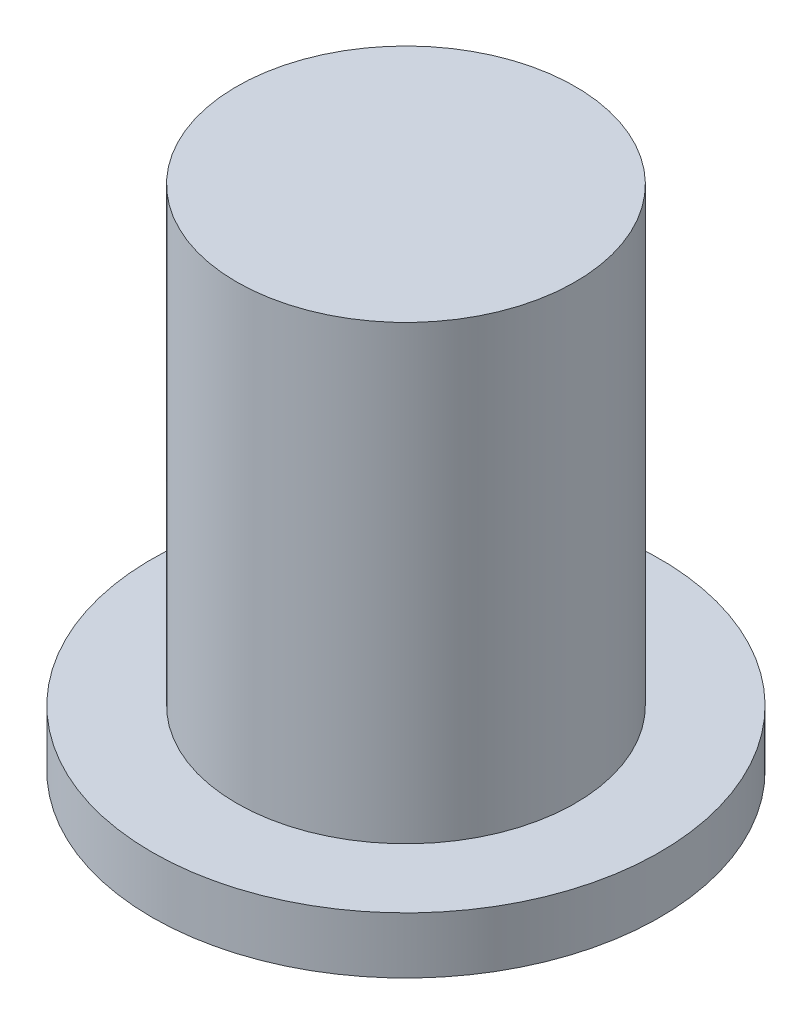
ISO-10303-21;
HEADER;
FILE_DESCRIPTION(('STEP AP214'),'2;1');
FILE_NAME('part.step','',(''),(''),'','','');
FILE_SCHEMA(('AUTOMOTIVE_DESIGN { 1 0 10303 214 1 1 1 1 }'));
ENDSEC;
DATA;
#1=APPLICATION_CONTEXT('core data for automotive mechanical design processes');
#2=APPLICATION_PROTOCOL_DEFINITION('international standard','automotive_design',2000,#1);
#3=PRODUCT_CONTEXT('',#1,'mechanical');
#4=PRODUCT('Part','Part','',(#3));
#5=PRODUCT_RELATED_PRODUCT_CATEGORY('part','',(#4));
#6=PRODUCT_DEFINITION_FORMATION('','',#4);
#7=PRODUCT_DEFINITION_CONTEXT('part definition',#1,'design');
#8=PRODUCT_DEFINITION('design','',#6,#7);
#9=PRODUCT_DEFINITION_SHAPE('','',#8);
#10=(LENGTH_UNIT() NAMED_UNIT(*) SI_UNIT(.MILLI.,.METRE.));
#11=(NAMED_UNIT(*) PLANE_ANGLE_UNIT() SI_UNIT($,.RADIAN.));
#12=(NAMED_UNIT(*) SI_UNIT($,.STERADIAN.) SOLID_ANGLE_UNIT());
#13=UNCERTAINTY_MEASURE_WITH_UNIT(LENGTH_MEASURE(1.E-05),#10,'distance_accuracy_value','');
#14=(GEOMETRIC_REPRESENTATION_CONTEXT(3) GLOBAL_UNCERTAINTY_ASSIGNED_CONTEXT((#13)) GLOBAL_UNIT_ASSIGNED_CONTEXT((#10,
#11,#12)) REPRESENTATION_CONTEXT('',''));
#15=CARTESIAN_POINT('',(0.,0.,0.));
#16=DIRECTION('',(0.,0.,1.));
#17=DIRECTION('',(1.,0.,0.));
#18=AXIS2_PLACEMENT_3D('',#15,#16,#17);
#19=CARTESIAN_POINT('',(0.,1.,0.));
#20=DIRECTION('',(0.,-1.,0.));
#21=DIRECTION('',(0.,0.,-1.));
#22=AXIS2_PLACEMENT_3D('',#19,#20,#21);
#23=CYLINDRICAL_SURFACE('',#22,4.5);
#24=CARTESIAN_POINT('',(0.,1.,0.));
#25=DIRECTION('',(0.,1.,0.));
#26=DIRECTION('',(0.,0.,1.));
#27=AXIS2_PLACEMENT_3D('',#24,#25,#26);
#28=CIRCLE('',#27,4.5);
#29=CARTESIAN_POINT('',(0.,1.,4.5));
#30=VERTEX_POINT('',#29);
#31=EDGE_CURVE('E10',#30,#30,#28,.T.);
#32=ORIENTED_EDGE('',*,*,#31,.F.);
#33=EDGE_LOOP('',(#32));
#34=FACE_BOUND('',#33,.T.);
#35=CARTESIAN_POINT('',(0.,0.,0.));
#36=DIRECTION('',(0.,1.,0.));
#37=DIRECTION('',(0.,0.,1.));
#38=AXIS2_PLACEMENT_3D('',#35,#36,#37);
#39=CIRCLE('',#38,4.5);
#40=CARTESIAN_POINT('',(0.,0.,4.5));
#41=VERTEX_POINT('',#40);
#42=EDGE_CURVE('E38',#41,#41,#39,.T.);
#43=ORIENTED_EDGE('',*,*,#42,.T.);
#44=EDGE_LOOP('',(#43));
#45=FACE_BOUND('',#44,.T.);
#46=ADVANCED_FACE('F35',(#34,#45),#23,.T.);
#47=CARTESIAN_POINT('',(0.,1.,0.));
#48=DIRECTION('',(0.,1.,0.));
#49=DIRECTION('',(0.,0.,1.));
#50=AXIS2_PLACEMENT_3D('',#47,#48,#49);
#51=PLANE('',#50);
#52=CARTESIAN_POINT('',(0.,1.,0.));
#53=DIRECTION('',(0.,1.,0.));
#54=DIRECTION('',(0.,0.,1.));
#55=AXIS2_PLACEMENT_3D('',#52,#53,#54);
#56=CIRCLE('',#55,3.);
#57=CARTESIAN_POINT('',(0.,1.,3.));
#58=VERTEX_POINT('',#57);
#59=EDGE_CURVE('E49',#58,#58,#56,.T.);
#60=ORIENTED_EDGE('',*,*,#59,.F.);
#61=EDGE_LOOP('',(#60));
#62=FACE_BOUND('',#61,.T.);
#63=ORIENTED_EDGE('',*,*,#31,.T.);
#64=EDGE_LOOP('',(#63));
#65=FACE_BOUND('',#64,.T.);
#66=ADVANCED_FACE('F65',(#62,#65),#51,.T.);
#67=CARTESIAN_POINT('',(0.,0.,0.));
#68=DIRECTION('',(0.,1.,0.));
#69=DIRECTION('',(0.,0.,1.));
#70=AXIS2_PLACEMENT_3D('',#67,#68,#69);
#71=PLANE('',#70);
#72=ORIENTED_EDGE('',*,*,#42,.F.);
#73=EDGE_LOOP('',(#72));
#74=FACE_BOUND('',#73,.T.);
#75=ADVANCED_FACE('F61',(#74),#71,.F.);
#76=CARTESIAN_POINT('',(0.,9.,0.));
#77=DIRECTION('',(0.,-1.,0.));
#78=DIRECTION('',(0.,0.,-1.));
#79=AXIS2_PLACEMENT_3D('',#76,#77,#78);
#80=CYLINDRICAL_SURFACE('',#79,3.);
#81=CARTESIAN_POINT('',(0.,9.,0.));
#82=DIRECTION('',(0.,1.,0.));
#83=DIRECTION('',(0.,0.,1.));
#84=AXIS2_PLACEMENT_3D('',#81,#82,#83);
#85=CIRCLE('',#84,3.);
#86=CARTESIAN_POINT('',(0.,9.,3.));
#87=VERTEX_POINT('',#86);
#88=EDGE_CURVE('E47',#87,#87,#85,.T.);
#89=ORIENTED_EDGE('',*,*,#88,.F.);
#90=EDGE_LOOP('',(#89));
#91=FACE_BOUND('',#90,.T.);
#92=ORIENTED_EDGE('',*,*,#59,.T.);
#93=EDGE_LOOP('',(#92));
#94=FACE_BOUND('',#93,.T.);
#95=ADVANCED_FACE('F58',(#91,#94),#80,.T.);
#96=CARTESIAN_POINT('',(0.,9.,0.));
#97=DIRECTION('',(0.,1.,0.));
#98=DIRECTION('',(0.,0.,1.));
#99=AXIS2_PLACEMENT_3D('',#96,#97,#98);
#100=PLANE('',#99);
#101=ORIENTED_EDGE('',*,*,#88,.T.);
#102=EDGE_LOOP('',(#101));
#103=FACE_BOUND('',#102,.T.);
#104=ADVANCED_FACE('F56',(#103),#100,.T.);
#105=CLOSED_SHELL('',(#46,#66,#75,#95,#104));
#106=MANIFOLD_SOLID_BREP('B2',#105);
#107=ADVANCED_BREP_SHAPE_REPRESENTATION('',(#18,#106),#14);
#108=SHAPE_DEFINITION_REPRESENTATION(#9,#107);
ENDSEC;
END-ISO-10303-21;
